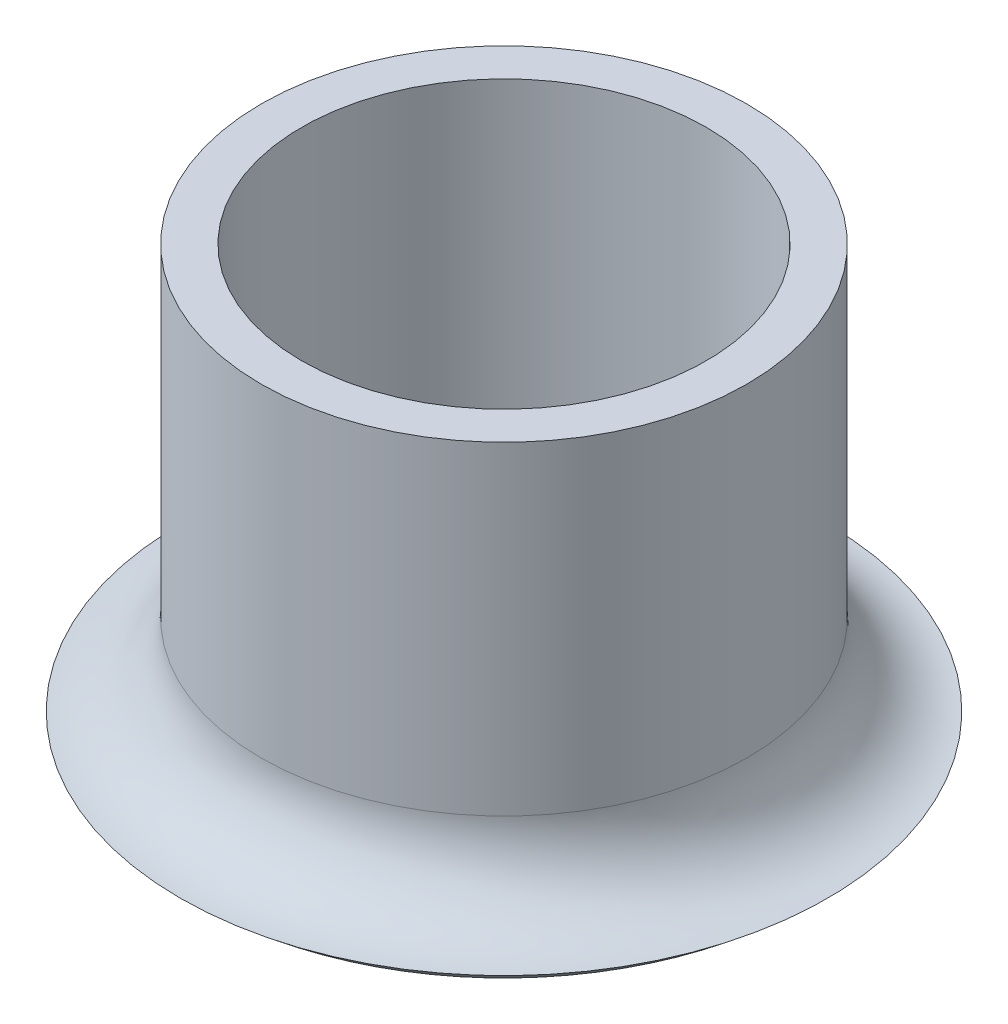
ISO-10303-21;
HEADER;
FILE_DESCRIPTION(('STEP AP214'),'2;1');
FILE_NAME('part.step','',(''),(''),'','','');
FILE_SCHEMA(('AUTOMOTIVE_DESIGN { 1 0 10303 214 1 1 1 1 }'));
ENDSEC;
DATA;
#1=APPLICATION_CONTEXT('core data for automotive mechanical design processes');
#2=APPLICATION_PROTOCOL_DEFINITION('international standard','automotive_design',2000,#1);
#3=PRODUCT_CONTEXT('',#1,'mechanical');
#4=PRODUCT('Part','Part','',(#3));
#5=PRODUCT_RELATED_PRODUCT_CATEGORY('part','',(#4));
#6=PRODUCT_DEFINITION_FORMATION('','',#4);
#7=PRODUCT_DEFINITION_CONTEXT('part definition',#1,'design');
#8=PRODUCT_DEFINITION('design','',#6,#7);
#9=PRODUCT_DEFINITION_SHAPE('','',#8);
#10=(LENGTH_UNIT() NAMED_UNIT(*) SI_UNIT(.MILLI.,.METRE.));
#11=(NAMED_UNIT(*) PLANE_ANGLE_UNIT() SI_UNIT($,.RADIAN.));
#12=(NAMED_UNIT(*) SI_UNIT($,.STERADIAN.) SOLID_ANGLE_UNIT());
#13=UNCERTAINTY_MEASURE_WITH_UNIT(LENGTH_MEASURE(1.E-05),#10,'distance_accuracy_value','');
#14=(GEOMETRIC_REPRESENTATION_CONTEXT(3) GLOBAL_UNCERTAINTY_ASSIGNED_CONTEXT((#13)) GLOBAL_UNIT_ASSIGNED_CONTEXT((#10,
#11,#12)) REPRESENTATION_CONTEXT('',''));
#15=CARTESIAN_POINT('',(0.,0.,0.));
#16=DIRECTION('',(0.,0.,1.));
#17=DIRECTION('',(1.,0.,0.));
#18=AXIS2_PLACEMENT_3D('',#15,#16,#17);
#19=CARTESIAN_POINT('',(0.,5.,0.));
#20=DIRECTION('',(0.,-1.,0.));
#21=DIRECTION('',(0.,0.,-1.));
#22=AXIS2_PLACEMENT_3D('',#19,#20,#21);
#23=CYLINDRICAL_SURFACE('',#22,3.);
#24=CARTESIAN_POINT('',(0.,1.,0.));
#25=DIRECTION('',(0.,-1.,0.));
#26=DIRECTION('',(0.,0.,-1.));
#27=AXIS2_PLACEMENT_3D('',#24,#25,#26);
#28=CIRCLE('',#27,3.);
#29=CARTESIAN_POINT('',(0.,1.,-3.));
#30=VERTEX_POINT('',#29);
#31=EDGE_CURVE('E39',#30,#30,#28,.F.);
#32=ORIENTED_EDGE('',*,*,#31,.T.);
#33=EDGE_LOOP('',(#32));
#34=FACE_BOUND('',#33,.T.);
#35=CARTESIAN_POINT('',(0.,5.,0.));
#36=DIRECTION('',(0.,1.,0.));
#37=DIRECTION('',(0.,0.,1.));
#38=AXIS2_PLACEMENT_3D('',#35,#36,#37);
#39=CIRCLE('',#38,3.);
#40=CARTESIAN_POINT('',(0.,5.,3.));
#41=VERTEX_POINT('',#40);
#42=EDGE_CURVE('E43',#41,#41,#39,.T.);
#43=ORIENTED_EDGE('',*,*,#42,.F.);
#44=EDGE_LOOP('',(#43));
#45=FACE_BOUND('',#44,.T.);
#46=ADVANCED_FACE('F32',(#34,#45),#23,.T.);
#47=CARTESIAN_POINT('',(0.,5.,0.));
#48=DIRECTION('',(0.,1.,0.));
#49=DIRECTION('',(0.,0.,1.));
#50=AXIS2_PLACEMENT_3D('',#47,#48,#49);
#51=PLANE('',#50);
#52=CARTESIAN_POINT('',(0.,5.,0.));
#53=DIRECTION('',(0.,1.,0.));
#54=DIRECTION('',(0.,0.,1.));
#55=AXIS2_PLACEMENT_3D('',#52,#53,#54);
#56=CIRCLE('',#55,2.5);
#57=CARTESIAN_POINT('',(0.,5.,2.5));
#58=VERTEX_POINT('',#57);
#59=EDGE_CURVE('E50',#58,#58,#56,.T.);
#60=ORIENTED_EDGE('',*,*,#59,.F.);
#61=EDGE_LOOP('',(#60));
#62=FACE_BOUND('',#61,.T.);
#63=ORIENTED_EDGE('',*,*,#42,.T.);
#64=EDGE_LOOP('',(#63));
#65=FACE_BOUND('',#64,.T.);
#66=ADVANCED_FACE('F73',(#62,#65),#51,.T.);
#67=CARTESIAN_POINT('',(0.,1.,0.));
#68=DIRECTION('',(0.,1.,0.));
#69=DIRECTION('',(0.,0.,1.));
#70=AXIS2_PLACEMENT_3D('',#67,#68,#69);
#71=CYLINDRICAL_SURFACE('',#70,2.5);
#72=CARTESIAN_POINT('',(0.,1.,0.));
#73=DIRECTION('',(0.,1.,0.));
#74=DIRECTION('',(0.,0.,1.));
#75=AXIS2_PLACEMENT_3D('',#72,#73,#74);
#76=CIRCLE('',#75,2.5);
#77=CARTESIAN_POINT('',(0.,1.,2.5));
#78=VERTEX_POINT('',#77);
#79=EDGE_CURVE('E47',#78,#78,#76,.T.);
#80=ORIENTED_EDGE('',*,*,#79,.F.);
#81=EDGE_LOOP('',(#80));
#82=FACE_BOUND('',#81,.T.);
#83=ORIENTED_EDGE('',*,*,#59,.T.);
#84=EDGE_LOOP('',(#83));
#85=FACE_BOUND('',#84,.T.);
#86=ADVANCED_FACE('F77',(#82,#85),#71,.F.);
#87=CARTESIAN_POINT('',(0.,1.,0.));
#88=DIRECTION('',(0.,1.,0.));
#89=DIRECTION('',(0.,0.,1.));
#90=AXIS2_PLACEMENT_3D('',#87,#88,#89);
#91=PLANE('',#90);
#92=ORIENTED_EDGE('',*,*,#79,.T.);
#93=EDGE_LOOP('',(#92));
#94=FACE_BOUND('',#93,.T.);
#95=ADVANCED_FACE('F69',(#94),#91,.T.);
#96=CARTESIAN_POINT('',(0.,-1.,0.));
#97=DIRECTION('',(0.,-1.,0.));
#98=DIRECTION('',(0.,0.,-1.));
#99=AXIS2_PLACEMENT_3D('',#96,#97,#98);
#100=PLANE('',#99);
#101=CARTESIAN_POINT('',(0.,-1.,0.));
#102=DIRECTION('',(0.,-1.,0.));
#103=DIRECTION('',(0.,0.,-1.));
#104=AXIS2_PLACEMENT_3D('',#101,#102,#103);
#105=CIRCLE('',#104,1.35424868893541);
#106=CARTESIAN_POINT('',(0.,-1.,-1.35424868893541));
#107=VERTEX_POINT('',#106);
#108=EDGE_CURVE('E10',#107,#107,#105,.T.);
#109=ORIENTED_EDGE('',*,*,#108,.T.);
#110=EDGE_LOOP('',(#109));
#111=FACE_BOUND('',#110,.T.);
#112=ADVANCED_FACE('F64',(#111),#100,.T.);
#113=CARTESIAN_POINT('',(0.,1.,0.));
#114=DIRECTION('',(0.,-1.,0.));
#115=DIRECTION('',(0.,0.,-1.));
#116=AXIS2_PLACEMENT_3D('',#113,#114,#115);
#117=TOROIDAL_SURFACE('',#116,4.,1.);
#118=CARTESIAN_POINT('',(0.,0.,0.));
#119=DIRECTION('',(0.,-1.,0.));
#120=DIRECTION('',(0.,0.,-1.));
#121=AXIS2_PLACEMENT_3D('',#118,#119,#120);
#122=CIRCLE('',#121,4.);
#123=CARTESIAN_POINT('',(0.,0.,-4.));
#124=VERTEX_POINT('',#123);
#125=EDGE_CURVE('E53',#124,#124,#122,.T.);
#126=ORIENTED_EDGE('',*,*,#125,.F.);
#127=EDGE_LOOP('',(#126));
#128=FACE_BOUND('',#127,.T.);
#129=ORIENTED_EDGE('',*,*,#31,.F.);
#130=EDGE_LOOP('',(#129));
#131=FACE_BOUND('',#130,.T.);
#132=ADVANCED_FACE('F61',(#128,#131),#117,.F.);
#133=CARTESIAN_POINT('',(0.,3.,0.));
#134=DIRECTION('',(0.,1.,0.));
#135=DIRECTION('',(0.,0.,1.));
#136=AXIS2_PLACEMENT_3D('',#133,#134,#135);
#137=DEGENERATE_TOROIDAL_SURFACE('',#136,1.35424868893541,4.,.T.);
#138=ORIENTED_EDGE('',*,*,#125,.T.);
#139=EDGE_LOOP('',(#138));
#140=FACE_BOUND('',#139,.T.);
#141=ORIENTED_EDGE('',*,*,#108,.F.);
#142=EDGE_LOOP('',(#141));
#143=FACE_BOUND('',#142,.T.);
#144=ADVANCED_FACE('F34',(#140,#143),#137,.T.);
#145=CLOSED_SHELL('',(#46,#66,#86,#95,#112,#132,#144));
#146=MANIFOLD_SOLID_BREP('B2',#145);
#147=ADVANCED_BREP_SHAPE_REPRESENTATION('',(#18,#146),#14);
#148=SHAPE_DEFINITION_REPRESENTATION(#9,#147);
ENDSEC;
END-ISO-10303-21;
